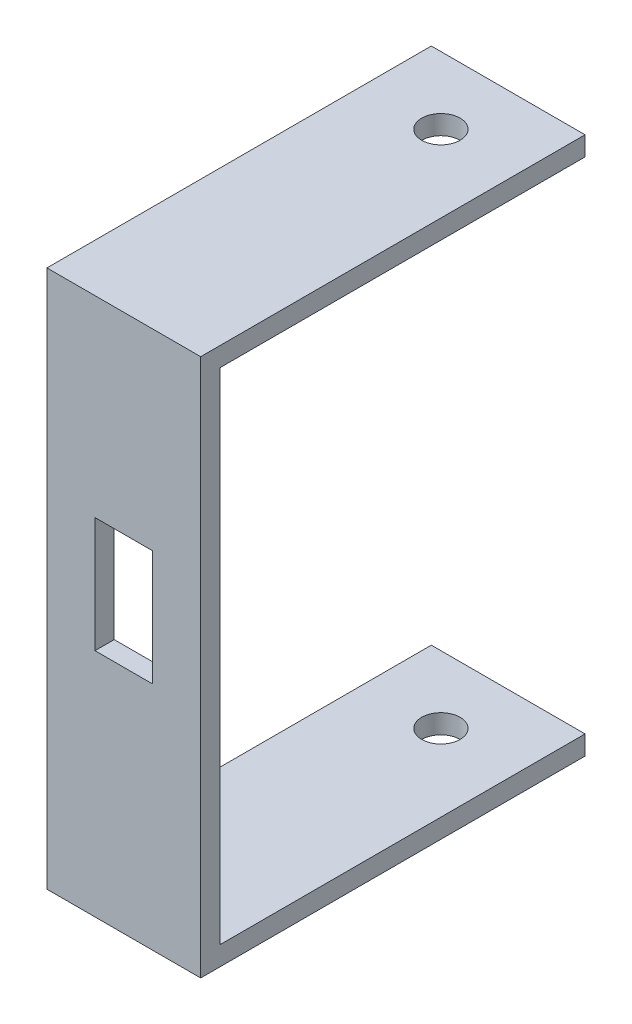
ISO-10303-21;
HEADER;
FILE_DESCRIPTION(('STEP AP214'),'2;1');
FILE_NAME('part.step','',(''),(''),'','','');
FILE_SCHEMA(('AUTOMOTIVE_DESIGN { 1 0 10303 214 1 1 1 1 }'));
ENDSEC;
DATA;
#1=APPLICATION_CONTEXT('core data for automotive mechanical design processes');
#2=APPLICATION_PROTOCOL_DEFINITION('international standard','automotive_design',2000,#1);
#3=PRODUCT_CONTEXT('',#1,'mechanical');
#4=PRODUCT('Part','Part','',(#3));
#5=PRODUCT_RELATED_PRODUCT_CATEGORY('part','',(#4));
#6=PRODUCT_DEFINITION_FORMATION('','',#4);
#7=PRODUCT_DEFINITION_CONTEXT('part definition',#1,'design');
#8=PRODUCT_DEFINITION('design','',#6,#7);
#9=PRODUCT_DEFINITION_SHAPE('','',#8);
#10=(LENGTH_UNIT() NAMED_UNIT(*) SI_UNIT(.MILLI.,.METRE.));
#11=(NAMED_UNIT(*) PLANE_ANGLE_UNIT() SI_UNIT($,.RADIAN.));
#12=(NAMED_UNIT(*) SI_UNIT($,.STERADIAN.) SOLID_ANGLE_UNIT());
#13=UNCERTAINTY_MEASURE_WITH_UNIT(LENGTH_MEASURE(1.E-05),#10,'distance_accuracy_value','');
#14=(GEOMETRIC_REPRESENTATION_CONTEXT(3) GLOBAL_UNCERTAINTY_ASSIGNED_CONTEXT((#13)) GLOBAL_UNIT_ASSIGNED_CONTEXT((#10,
#11,#12)) REPRESENTATION_CONTEXT('',''));
#15=CARTESIAN_POINT('',(0.,0.,0.));
#16=DIRECTION('',(0.,0.,1.));
#17=DIRECTION('',(1.,0.,0.));
#18=AXIS2_PLACEMENT_3D('',#15,#16,#17);
#19=CARTESIAN_POINT('',(12.7,-41.275,3.175));
#20=DIRECTION('',(-1.,0.,0.));
#21=DIRECTION('',(0.,0.,1.));
#22=AXIS2_PLACEMENT_3D('',#19,#20,#21);
#23=PLANE('',#22);
#24=DIRECTION('',(0.,1.,0.));
#25=VECTOR('',#24,1.);
#26=CARTESIAN_POINT('',(12.7,-41.275,0.));
#27=LINE('',#26,#25);
#28=CARTESIAN_POINT('',(12.7,-41.275,0.));
#29=VERTEX_POINT('',#28);
#30=CARTESIAN_POINT('',(12.7,41.275,0.));
#31=VERTEX_POINT('',#30);
#32=EDGE_CURVE('E217',#29,#31,#27,.T.);
#33=ORIENTED_EDGE('',*,*,#32,.T.);
#34=DIRECTION('',(0.,0.,-1.));
#35=VECTOR('',#34,1.);
#36=CARTESIAN_POINT('',(12.7,41.275,0.));
#37=LINE('',#36,#35);
#38=CARTESIAN_POINT('',(12.7,41.275,-60.325));
#39=VERTEX_POINT('',#38);
#40=EDGE_CURVE('E184',#31,#39,#37,.T.);
#41=ORIENTED_EDGE('',*,*,#40,.T.);
#42=DIRECTION('',(0.,-1.,0.));
#43=VECTOR('',#42,1.);
#44=CARTESIAN_POINT('',(12.7,44.45,-60.325));
#45=LINE('',#44,#43);
#46=CARTESIAN_POINT('',(12.7,44.45,-60.325));
#47=VERTEX_POINT('',#46);
#48=EDGE_CURVE('E206',#47,#39,#45,.T.);
#49=ORIENTED_EDGE('',*,*,#48,.F.);
#50=DIRECTION('',(0.,0.,-1.));
#51=VECTOR('',#50,1.);
#52=CARTESIAN_POINT('',(12.7,44.45,0.));
#53=LINE('',#52,#51);
#54=CARTESIAN_POINT('',(12.7,44.45,3.175));
#55=VERTEX_POINT('',#54);
#56=EDGE_CURVE('E133',#55,#47,#53,.T.);
#57=ORIENTED_EDGE('',*,*,#56,.F.);
#58=DIRECTION('',(0.,1.,0.));
#59=VECTOR('',#58,1.);
#60=CARTESIAN_POINT('',(12.7,-41.275,3.175));
#61=LINE('',#60,#59);
#62=CARTESIAN_POINT('',(12.7,-44.45,3.175));
#63=VERTEX_POINT('',#62);
#64=EDGE_CURVE('E125',#63,#55,#61,.T.);
#65=ORIENTED_EDGE('',*,*,#64,.F.);
#66=DIRECTION('',(0.,0.,-1.));
#67=VECTOR('',#66,1.);
#68=CARTESIAN_POINT('',(12.7,-44.45,0.));
#69=LINE('',#68,#67);
#70=CARTESIAN_POINT('',(12.7,-44.45,-60.325));
#71=VERTEX_POINT('',#70);
#72=EDGE_CURVE('E129',#63,#71,#69,.T.);
#73=ORIENTED_EDGE('',*,*,#72,.T.);
#74=DIRECTION('',(0.,1.,0.));
#75=VECTOR('',#74,1.);
#76=CARTESIAN_POINT('',(12.7,-44.45,-60.325));
#77=LINE('',#76,#75);
#78=CARTESIAN_POINT('',(12.7,-41.275,-60.325));
#79=VERTEX_POINT('',#78);
#80=EDGE_CURVE('E157',#71,#79,#77,.T.);
#81=ORIENTED_EDGE('',*,*,#80,.T.);
#82=DIRECTION('',(0.,0.,-1.));
#83=VECTOR('',#82,1.);
#84=CARTESIAN_POINT('',(12.7,-41.275,0.));
#85=LINE('',#84,#83);
#86=EDGE_CURVE('E163',#29,#79,#85,.T.);
#87=ORIENTED_EDGE('',*,*,#86,.F.);
#88=EDGE_LOOP('',(#33,#41,#49,#57,#65,#73,#81,#87));
#89=FACE_BOUND('',#88,.T.);
#90=ADVANCED_FACE('F35',(#89),#23,.F.);
#91=CARTESIAN_POINT('',(-12.7,-41.275,3.175));
#92=DIRECTION('',(1.,0.,0.));
#93=DIRECTION('',(0.,0.,-1.));
#94=AXIS2_PLACEMENT_3D('',#91,#92,#93);
#95=PLANE('',#94);
#96=DIRECTION('',(0.,-1.,0.));
#97=VECTOR('',#96,1.);
#98=CARTESIAN_POINT('',(-12.7,-41.275,0.));
#99=LINE('',#98,#97);
#100=CARTESIAN_POINT('',(-12.7,41.275,0.));
#101=VERTEX_POINT('',#100);
#102=CARTESIAN_POINT('',(-12.7,-41.275,0.));
#103=VERTEX_POINT('',#102);
#104=EDGE_CURVE('E224',#101,#103,#99,.T.);
#105=ORIENTED_EDGE('',*,*,#104,.T.);
#106=DIRECTION('',(0.,0.,1.));
#107=VECTOR('',#106,1.);
#108=CARTESIAN_POINT('',(-12.7,-41.275,0.));
#109=LINE('',#108,#107);
#110=CARTESIAN_POINT('',(-12.7,-41.275,-60.325));
#111=VERTEX_POINT('',#110);
#112=EDGE_CURVE('E166',#111,#103,#109,.T.);
#113=ORIENTED_EDGE('',*,*,#112,.F.);
#114=DIRECTION('',(0.,1.,0.));
#115=VECTOR('',#114,1.);
#116=CARTESIAN_POINT('',(-12.7,-44.45,-60.325));
#117=LINE('',#116,#115);
#118=CARTESIAN_POINT('',(-12.7,-44.45,-60.325));
#119=VERTEX_POINT('',#118);
#120=EDGE_CURVE('E168',#119,#111,#117,.T.);
#121=ORIENTED_EDGE('',*,*,#120,.F.);
#122=DIRECTION('',(0.,0.,1.));
#123=VECTOR('',#122,1.);
#124=CARTESIAN_POINT('',(-12.7,-44.45,0.));
#125=LINE('',#124,#123);
#126=CARTESIAN_POINT('',(-12.7,-44.45,3.175));
#127=VERTEX_POINT('',#126);
#128=EDGE_CURVE('E151',#119,#127,#125,.T.);
#129=ORIENTED_EDGE('',*,*,#128,.T.);
#130=DIRECTION('',(0.,-1.,0.));
#131=VECTOR('',#130,1.);
#132=CARTESIAN_POINT('',(-12.7,-41.275,3.175));
#133=LINE('',#132,#131);
#134=CARTESIAN_POINT('',(-12.7,44.45,3.175));
#135=VERTEX_POINT('',#134);
#136=EDGE_CURVE('E138',#135,#127,#133,.T.);
#137=ORIENTED_EDGE('',*,*,#136,.F.);
#138=DIRECTION('',(0.,0.,1.));
#139=VECTOR('',#138,1.);
#140=CARTESIAN_POINT('',(-12.7,44.45,0.));
#141=LINE('',#140,#139);
#142=CARTESIAN_POINT('',(-12.7,44.45,-60.325));
#143=VERTEX_POINT('',#142);
#144=EDGE_CURVE('E193',#143,#135,#141,.T.);
#145=ORIENTED_EDGE('',*,*,#144,.F.);
#146=DIRECTION('',(0.,-1.,0.));
#147=VECTOR('',#146,1.);
#148=CARTESIAN_POINT('',(-12.7,44.45,-60.325));
#149=LINE('',#148,#147);
#150=CARTESIAN_POINT('',(-12.7,41.275,-60.325));
#151=VERTEX_POINT('',#150);
#152=EDGE_CURVE('E198',#143,#151,#149,.T.);
#153=ORIENTED_EDGE('',*,*,#152,.T.);
#154=DIRECTION('',(0.,0.,1.));
#155=VECTOR('',#154,1.);
#156=CARTESIAN_POINT('',(-12.7,41.275,0.));
#157=LINE('',#156,#155);
#158=EDGE_CURVE('E191',#151,#101,#157,.T.);
#159=ORIENTED_EDGE('',*,*,#158,.T.);
#160=EDGE_LOOP('',(#105,#113,#121,#129,#137,#145,#153,#159));
#161=FACE_BOUND('',#160,.T.);
#162=ADVANCED_FACE('F255',(#161),#95,.F.);
#163=CARTESIAN_POINT('',(0.,0.,3.175));
#164=DIRECTION('',(0.,0.,-1.));
#165=DIRECTION('',(-1.,0.,0.));
#166=AXIS2_PLACEMENT_3D('',#163,#164,#165);
#167=PLANE('',#166);
#168=DIRECTION('',(-1.,0.,0.));
#169=VECTOR('',#168,1.);
#170=CARTESIAN_POINT('',(-4.7625,12.7,3.175));
#171=LINE('',#170,#169);
#172=CARTESIAN_POINT('',(4.7625,12.7,3.175));
#173=VERTEX_POINT('',#172);
#174=CARTESIAN_POINT('',(-4.7625,12.7,3.175));
#175=VERTEX_POINT('',#174);
#176=EDGE_CURVE('E173',#173,#175,#171,.T.);
#177=ORIENTED_EDGE('',*,*,#176,.F.);
#178=DIRECTION('',(0.,1.,0.));
#179=VECTOR('',#178,1.);
#180=CARTESIAN_POINT('',(4.7625,12.7,3.175));
#181=LINE('',#180,#179);
#182=CARTESIAN_POINT('',(4.7625,-6.35000000000001,3.175));
#183=VERTEX_POINT('',#182);
#184=EDGE_CURVE('E51',#183,#173,#181,.T.);
#185=ORIENTED_EDGE('',*,*,#184,.F.);
#186=DIRECTION('',(1.,0.,0.));
#187=VECTOR('',#186,1.);
#188=CARTESIAN_POINT('',(-4.7625,-6.35000000000001,3.175));
#189=LINE('',#188,#187);
#190=CARTESIAN_POINT('',(-4.7625,-6.35000000000001,3.175));
#191=VERTEX_POINT('',#190);
#192=EDGE_CURVE('E178',#191,#183,#189,.T.);
#193=ORIENTED_EDGE('',*,*,#192,.F.);
#194=DIRECTION('',(0.,-1.,0.));
#195=VECTOR('',#194,1.);
#196=CARTESIAN_POINT('',(-4.7625,12.7,3.175));
#197=LINE('',#196,#195);
#198=EDGE_CURVE('E175',#175,#191,#197,.T.);
#199=ORIENTED_EDGE('',*,*,#198,.F.);
#200=EDGE_LOOP('',(#177,#185,#193,#199));
#201=FACE_BOUND('',#200,.T.);
#202=ORIENTED_EDGE('',*,*,#64,.T.);
#203=DIRECTION('',(1.,0.,0.));
#204=VECTOR('',#203,1.);
#205=CARTESIAN_POINT('',(0.,44.45,3.175));
#206=LINE('',#205,#204);
#207=EDGE_CURVE('E196',#135,#55,#206,.T.);
#208=ORIENTED_EDGE('',*,*,#207,.F.);
#209=ORIENTED_EDGE('',*,*,#136,.T.);
#210=DIRECTION('',(1.,0.,0.));
#211=VECTOR('',#210,1.);
#212=CARTESIAN_POINT('',(0.,-44.45,3.175));
#213=LINE('',#212,#211);
#214=EDGE_CURVE('E144',#127,#63,#213,.T.);
#215=ORIENTED_EDGE('',*,*,#214,.T.);
#216=EDGE_LOOP('',(#202,#208,#209,#215));
#217=FACE_BOUND('',#216,.T.);
#218=ADVANCED_FACE('F150',(#201,#217),#167,.F.);
#219=CARTESIAN_POINT('',(0.,0.,0.));
#220=DIRECTION('',(0.,0.,-1.));
#221=DIRECTION('',(-1.,0.,0.));
#222=AXIS2_PLACEMENT_3D('',#219,#220,#221);
#223=PLANE('',#222);
#224=DIRECTION('',(0.,-1.,0.));
#225=VECTOR('',#224,1.);
#226=CARTESIAN_POINT('',(4.7625,0.,0.));
#227=LINE('',#226,#225);
#228=CARTESIAN_POINT('',(4.7625,12.7,0.));
#229=VERTEX_POINT('',#228);
#230=CARTESIAN_POINT('',(4.7625,-6.35000000000001,0.));
#231=VERTEX_POINT('',#230);
#232=EDGE_CURVE('E11',#229,#231,#227,.T.);
#233=ORIENTED_EDGE('',*,*,#232,.F.);
#234=DIRECTION('',(1.,0.,0.));
#235=VECTOR('',#234,1.);
#236=CARTESIAN_POINT('',(0.,12.7,0.));
#237=LINE('',#236,#235);
#238=CARTESIAN_POINT('',(-4.7625,12.7,0.));
#239=VERTEX_POINT('',#238);
#240=EDGE_CURVE('E231',#239,#229,#237,.T.);
#241=ORIENTED_EDGE('',*,*,#240,.F.);
#242=DIRECTION('',(0.,1.,0.));
#243=VECTOR('',#242,1.);
#244=CARTESIAN_POINT('',(-4.7625,0.,0.));
#245=LINE('',#244,#243);
#246=CARTESIAN_POINT('',(-4.7625,-6.35000000000001,0.));
#247=VERTEX_POINT('',#246);
#248=EDGE_CURVE('E233',#247,#239,#245,.T.);
#249=ORIENTED_EDGE('',*,*,#248,.F.);
#250=DIRECTION('',(-1.,0.,0.));
#251=VECTOR('',#250,1.);
#252=CARTESIAN_POINT('',(0.,-6.35000000000001,0.));
#253=LINE('',#252,#251);
#254=EDGE_CURVE('E44',#231,#247,#253,.T.);
#255=ORIENTED_EDGE('',*,*,#254,.F.);
#256=EDGE_LOOP('',(#233,#241,#249,#255));
#257=FACE_BOUND('',#256,.T.);
#258=ORIENTED_EDGE('',*,*,#32,.F.);
#259=DIRECTION('',(1.,0.,0.));
#260=VECTOR('',#259,1.);
#261=CARTESIAN_POINT('',(-12.7,-41.275,0.));
#262=LINE('',#261,#260);
#263=EDGE_CURVE('E38',#103,#29,#262,.T.);
#264=ORIENTED_EDGE('',*,*,#263,.F.);
#265=ORIENTED_EDGE('',*,*,#104,.F.);
#266=DIRECTION('',(-1.,0.,0.));
#267=VECTOR('',#266,1.);
#268=CARTESIAN_POINT('',(-12.7,41.275,0.));
#269=LINE('',#268,#267);
#270=EDGE_CURVE('E219',#31,#101,#269,.T.);
#271=ORIENTED_EDGE('',*,*,#270,.F.);
#272=EDGE_LOOP('',(#258,#264,#265,#271));
#273=FACE_BOUND('',#272,.T.);
#274=ADVANCED_FACE('F248',(#257,#273),#223,.T.);
#275=CARTESIAN_POINT('',(0.,41.275,0.));
#276=DIRECTION('',(0.,1.,0.));
#277=DIRECTION('',(0.,0.,1.));
#278=AXIS2_PLACEMENT_3D('',#275,#276,#277);
#279=PLANE('',#278);
#280=CARTESIAN_POINT('',(0.,41.275,-49.2125));
#281=DIRECTION('',(0.,1.,0.));
#282=DIRECTION('',(0.,0.,1.));
#283=AXIS2_PLACEMENT_3D('',#280,#281,#282);
#284=CIRCLE('',#283,3.175);
#285=CARTESIAN_POINT('',(0.,41.275,-46.0375));
#286=VERTEX_POINT('',#285);
#287=EDGE_CURVE('E167',#286,#286,#284,.T.);
#288=ORIENTED_EDGE('',*,*,#287,.T.);
#289=EDGE_LOOP('',(#288));
#290=FACE_BOUND('',#289,.T.);
#291=ORIENTED_EDGE('',*,*,#40,.F.);
#292=ORIENTED_EDGE('',*,*,#270,.T.);
#293=ORIENTED_EDGE('',*,*,#158,.F.);
#294=DIRECTION('',(-1.,0.,0.));
#295=VECTOR('',#294,1.);
#296=CARTESIAN_POINT('',(0.,41.275,-60.325));
#297=LINE('',#296,#295);
#298=EDGE_CURVE('E201',#39,#151,#297,.T.);
#299=ORIENTED_EDGE('',*,*,#298,.F.);
#300=EDGE_LOOP('',(#291,#292,#293,#299));
#301=FACE_BOUND('',#300,.T.);
#302=ADVANCED_FACE('F261',(#290,#301),#279,.F.);
#303=CARTESIAN_POINT('',(0.,44.45,-60.325));
#304=DIRECTION('',(0.,0.,1.));
#305=DIRECTION('',(1.,0.,0.));
#306=AXIS2_PLACEMENT_3D('',#303,#304,#305);
#307=PLANE('',#306);
#308=ORIENTED_EDGE('',*,*,#298,.T.);
#309=ORIENTED_EDGE('',*,*,#152,.F.);
#310=DIRECTION('',(-1.,0.,0.));
#311=VECTOR('',#310,1.);
#312=CARTESIAN_POINT('',(0.,44.45,-60.325));
#313=LINE('',#312,#311);
#314=EDGE_CURVE('E190',#47,#143,#313,.T.);
#315=ORIENTED_EDGE('',*,*,#314,.F.);
#316=ORIENTED_EDGE('',*,*,#48,.T.);
#317=EDGE_LOOP('',(#308,#309,#315,#316));
#318=FACE_BOUND('',#317,.T.);
#319=ADVANCED_FACE('F312',(#318),#307,.F.);
#320=CARTESIAN_POINT('',(0.,44.45,0.));
#321=DIRECTION('',(0.,1.,0.));
#322=DIRECTION('',(0.,0.,1.));
#323=AXIS2_PLACEMENT_3D('',#320,#321,#322);
#324=PLANE('',#323);
#325=CARTESIAN_POINT('',(0.,44.45,-49.2125));
#326=DIRECTION('',(0.,1.,0.));
#327=DIRECTION('',(0.,0.,1.));
#328=AXIS2_PLACEMENT_3D('',#325,#326,#327);
#329=CIRCLE('',#328,3.175);
#330=CARTESIAN_POINT('',(0.,44.45,-46.0375));
#331=VERTEX_POINT('',#330);
#332=EDGE_CURVE('E472',#331,#331,#329,.T.);
#333=ORIENTED_EDGE('',*,*,#332,.F.);
#334=EDGE_LOOP('',(#333));
#335=FACE_BOUND('',#334,.T.);
#336=ORIENTED_EDGE('',*,*,#56,.T.);
#337=ORIENTED_EDGE('',*,*,#314,.T.);
#338=ORIENTED_EDGE('',*,*,#144,.T.);
#339=ORIENTED_EDGE('',*,*,#207,.T.);
#340=EDGE_LOOP('',(#336,#337,#338,#339));
#341=FACE_BOUND('',#340,.T.);
#342=ADVANCED_FACE('F321',(#335,#341),#324,.T.);
#343=CARTESIAN_POINT('',(4.7625,12.7,-60.325025));
#344=DIRECTION('',(1.,0.,0.));
#345=DIRECTION('',(0.,1.,0.));
#346=AXIS2_PLACEMENT_3D('',#343,#344,#345);
#347=PLANE('',#346);
#348=ORIENTED_EDGE('',*,*,#232,.T.);
#349=DIRECTION('',(0.,0.,1.));
#350=VECTOR('',#349,1.);
#351=CARTESIAN_POINT('',(4.7625,-6.35000000000001,-60.325025));
#352=LINE('',#351,#350);
#353=EDGE_CURVE('E182',#231,#183,#352,.T.);
#354=ORIENTED_EDGE('',*,*,#353,.T.);
#355=ORIENTED_EDGE('',*,*,#184,.T.);
#356=DIRECTION('',(0.,0.,1.));
#357=VECTOR('',#356,1.);
#358=CARTESIAN_POINT('',(4.7625,12.7,-60.325025));
#359=LINE('',#358,#357);
#360=EDGE_CURVE('E181',#229,#173,#359,.T.);
#361=ORIENTED_EDGE('',*,*,#360,.F.);
#362=EDGE_LOOP('',(#348,#354,#355,#361));
#363=FACE_BOUND('',#362,.T.);
#364=ADVANCED_FACE('F252',(#363),#347,.F.);
#365=CARTESIAN_POINT('',(-4.7625,-6.35000000000001,-60.325025));
#366=DIRECTION('',(0.,-1.,0.));
#367=DIRECTION('',(0.,0.,-1.));
#368=AXIS2_PLACEMENT_3D('',#365,#366,#367);
#369=PLANE('',#368);
#370=ORIENTED_EDGE('',*,*,#254,.T.);
#371=DIRECTION('',(0.,0.,1.));
#372=VECTOR('',#371,1.);
#373=CARTESIAN_POINT('',(-4.7625,-6.35000000000001,-60.325025));
#374=LINE('',#373,#372);
#375=EDGE_CURVE('E185',#247,#191,#374,.T.);
#376=ORIENTED_EDGE('',*,*,#375,.T.);
#377=ORIENTED_EDGE('',*,*,#192,.T.);
#378=ORIENTED_EDGE('',*,*,#353,.F.);
#379=EDGE_LOOP('',(#370,#376,#377,#378));
#380=FACE_BOUND('',#379,.T.);
#381=ADVANCED_FACE('F239',(#380),#369,.F.);
#382=CARTESIAN_POINT('',(-4.7625,12.7,-60.325025));
#383=DIRECTION('',(-1.,0.,0.));
#384=DIRECTION('',(0.,-1.,0.));
#385=AXIS2_PLACEMENT_3D('',#382,#383,#384);
#386=PLANE('',#385);
#387=ORIENTED_EDGE('',*,*,#248,.T.);
#388=DIRECTION('',(0.,0.,1.));
#389=VECTOR('',#388,1.);
#390=CARTESIAN_POINT('',(-4.7625,12.7,-60.325025));
#391=LINE('',#390,#389);
#392=EDGE_CURVE('E59',#239,#175,#391,.T.);
#393=ORIENTED_EDGE('',*,*,#392,.T.);
#394=ORIENTED_EDGE('',*,*,#198,.T.);
#395=ORIENTED_EDGE('',*,*,#375,.F.);
#396=EDGE_LOOP('',(#387,#393,#394,#395));
#397=FACE_BOUND('',#396,.T.);
#398=ADVANCED_FACE('F244',(#397),#386,.F.);
#399=CARTESIAN_POINT('',(-4.7625,12.7,-60.325025));
#400=DIRECTION('',(0.,1.,0.));
#401=DIRECTION('',(0.,0.,1.));
#402=AXIS2_PLACEMENT_3D('',#399,#400,#401);
#403=PLANE('',#402);
#404=ORIENTED_EDGE('',*,*,#240,.T.);
#405=ORIENTED_EDGE('',*,*,#360,.T.);
#406=ORIENTED_EDGE('',*,*,#176,.T.);
#407=ORIENTED_EDGE('',*,*,#392,.F.);
#408=EDGE_LOOP('',(#404,#405,#406,#407));
#409=FACE_BOUND('',#408,.T.);
#410=ADVANCED_FACE('F250',(#409),#403,.F.);
#411=CARTESIAN_POINT('',(0.,-41.275,0.));
#412=DIRECTION('',(0.,-1.,0.));
#413=DIRECTION('',(0.,0.,1.));
#414=AXIS2_PLACEMENT_3D('',#411,#412,#413);
#415=PLANE('',#414);
#416=CARTESIAN_POINT('',(0.,-41.275,-49.2125));
#417=DIRECTION('',(0.,-1.,0.));
#418=DIRECTION('',(0.,0.,-1.));
#419=AXIS2_PLACEMENT_3D('',#416,#417,#418);
#420=CIRCLE('',#419,3.175);
#421=CARTESIAN_POINT('',(0.,-41.275,-52.3875));
#422=VERTEX_POINT('',#421);
#423=EDGE_CURVE('E475',#422,#422,#420,.T.);
#424=ORIENTED_EDGE('',*,*,#423,.T.);
#425=EDGE_LOOP('',(#424));
#426=FACE_BOUND('',#425,.T.);
#427=ORIENTED_EDGE('',*,*,#112,.T.);
#428=ORIENTED_EDGE('',*,*,#263,.T.);
#429=ORIENTED_EDGE('',*,*,#86,.T.);
#430=DIRECTION('',(-1.,0.,0.));
#431=VECTOR('',#430,1.);
#432=CARTESIAN_POINT('',(0.,-41.275,-60.325));
#433=LINE('',#432,#431);
#434=EDGE_CURVE('E148',#79,#111,#433,.T.);
#435=ORIENTED_EDGE('',*,*,#434,.T.);
#436=EDGE_LOOP('',(#427,#428,#429,#435));
#437=FACE_BOUND('',#436,.T.);
#438=ADVANCED_FACE('F299',(#426,#437),#415,.F.);
#439=CARTESIAN_POINT('',(0.,-44.45,-60.325));
#440=DIRECTION('',(0.,0.,-1.));
#441=DIRECTION('',(-1.,0.,0.));
#442=AXIS2_PLACEMENT_3D('',#439,#440,#441);
#443=PLANE('',#442);
#444=ORIENTED_EDGE('',*,*,#434,.F.);
#445=ORIENTED_EDGE('',*,*,#80,.F.);
#446=DIRECTION('',(-1.,0.,0.));
#447=VECTOR('',#446,1.);
#448=CARTESIAN_POINT('',(0.,-44.45,-60.325));
#449=LINE('',#448,#447);
#450=EDGE_CURVE('E147',#71,#119,#449,.T.);
#451=ORIENTED_EDGE('',*,*,#450,.T.);
#452=ORIENTED_EDGE('',*,*,#120,.T.);
#453=EDGE_LOOP('',(#444,#445,#451,#452));
#454=FACE_BOUND('',#453,.T.);
#455=ADVANCED_FACE('F294',(#454),#443,.T.);
#456=CARTESIAN_POINT('',(0.,-44.45,0.));
#457=DIRECTION('',(0.,-1.,0.));
#458=DIRECTION('',(0.,0.,1.));
#459=AXIS2_PLACEMENT_3D('',#456,#457,#458);
#460=PLANE('',#459);
#461=CARTESIAN_POINT('',(0.,-44.45,-49.2125));
#462=DIRECTION('',(0.,1.,0.));
#463=DIRECTION('',(0.,0.,1.));
#464=AXIS2_PLACEMENT_3D('',#461,#462,#463);
#465=CIRCLE('',#464,3.175);
#466=CARTESIAN_POINT('',(0.,-44.45,-46.0375));
#467=VERTEX_POINT('',#466);
#468=EDGE_CURVE('E477',#467,#467,#465,.T.);
#469=ORIENTED_EDGE('',*,*,#468,.T.);
#470=EDGE_LOOP('',(#469));
#471=FACE_BOUND('',#470,.T.);
#472=ORIENTED_EDGE('',*,*,#72,.F.);
#473=ORIENTED_EDGE('',*,*,#214,.F.);
#474=ORIENTED_EDGE('',*,*,#128,.F.);
#475=ORIENTED_EDGE('',*,*,#450,.F.);
#476=EDGE_LOOP('',(#472,#473,#474,#475));
#477=FACE_BOUND('',#476,.T.);
#478=ADVANCED_FACE('F142',(#471,#477),#460,.T.);
#479=CARTESIAN_POINT('',(0.,-44.45,-49.2125));
#480=DIRECTION('',(0.,1.,0.));
#481=DIRECTION('',(0.,0.,1.));
#482=AXIS2_PLACEMENT_3D('',#479,#480,#481);
#483=CYLINDRICAL_SURFACE('',#482,3.175);
#484=ORIENTED_EDGE('',*,*,#468,.F.);
#485=EDGE_LOOP('',(#484));
#486=FACE_BOUND('',#485,.T.);
#487=ORIENTED_EDGE('',*,*,#423,.F.);
#488=EDGE_LOOP('',(#487));
#489=FACE_BOUND('',#488,.T.);
#490=ADVANCED_FACE('F345',(#486,#489),#483,.F.);
#491=ORIENTED_EDGE('',*,*,#332,.T.);
#492=EDGE_LOOP('',(#491));
#493=FACE_BOUND('',#492,.T.);
#494=ORIENTED_EDGE('',*,*,#287,.F.);
#495=EDGE_LOOP('',(#494));
#496=FACE_BOUND('',#495,.T.);
#497=ADVANCED_FACE('F355',(#493,#496),#483,.F.);
#498=CLOSED_SHELL('',(#90,#162,#218,#274,#302,#319,#342,#364,#381,#398,#410,#438,#455,#478,#490,#497));
#499=MANIFOLD_SOLID_BREP('B2',#498);
#500=ADVANCED_BREP_SHAPE_REPRESENTATION('',(#18,#499),#14);
#501=SHAPE_DEFINITION_REPRESENTATION(#9,#500);
ENDSEC;
END-ISO-10303-21;
